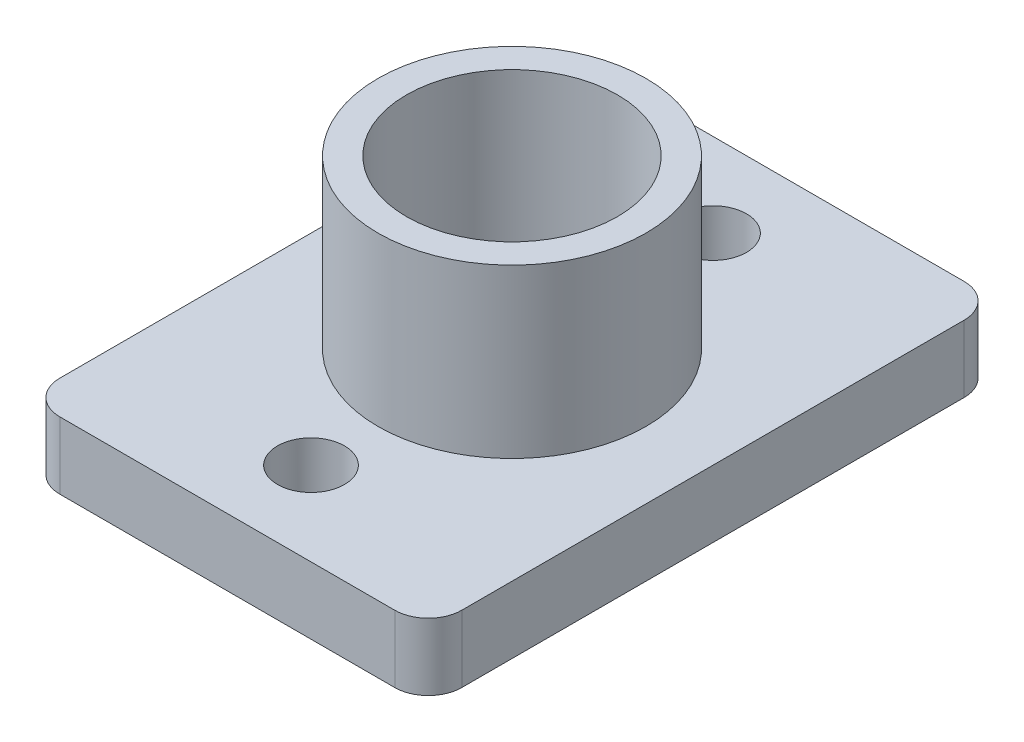
ISO-10303-21;
HEADER;
FILE_DESCRIPTION(('STEP AP214'),'2;1');
FILE_NAME('part.step','',(''),(''),'','','');
FILE_SCHEMA(('AUTOMOTIVE_DESIGN { 1 0 10303 214 1 1 1 1 }'));
ENDSEC;
DATA;
#1=APPLICATION_CONTEXT('core data for automotive mechanical design processes');
#2=APPLICATION_PROTOCOL_DEFINITION('international standard','automotive_design',2000,#1);
#3=PRODUCT_CONTEXT('',#1,'mechanical');
#4=PRODUCT('Part','Part','',(#3));
#5=PRODUCT_RELATED_PRODUCT_CATEGORY('part','',(#4));
#6=PRODUCT_DEFINITION_FORMATION('','',#4);
#7=PRODUCT_DEFINITION_CONTEXT('part definition',#1,'design');
#8=PRODUCT_DEFINITION('design','',#6,#7);
#9=PRODUCT_DEFINITION_SHAPE('','',#8);
#10=(LENGTH_UNIT() NAMED_UNIT(*) SI_UNIT(.MILLI.,.METRE.));
#11=(NAMED_UNIT(*) PLANE_ANGLE_UNIT() SI_UNIT($,.RADIAN.));
#12=(NAMED_UNIT(*) SI_UNIT($,.STERADIAN.) SOLID_ANGLE_UNIT());
#13=UNCERTAINTY_MEASURE_WITH_UNIT(LENGTH_MEASURE(1.E-05),#10,'distance_accuracy_value','');
#14=(GEOMETRIC_REPRESENTATION_CONTEXT(3) GLOBAL_UNCERTAINTY_ASSIGNED_CONTEXT((#13)) GLOBAL_UNIT_ASSIGNED_CONTEXT((#10,
#11,#12)) REPRESENTATION_CONTEXT('',''));
#15=CARTESIAN_POINT('',(0.,0.,0.));
#16=DIRECTION('',(0.,0.,1.));
#17=DIRECTION('',(1.,0.,0.));
#18=AXIS2_PLACEMENT_3D('',#15,#16,#17);
#19=CARTESIAN_POINT('',(0.,2.,0.));
#20=DIRECTION('',(1.,0.,0.));
#21=DIRECTION('',(0.,0.,-1.));
#22=AXIS2_PLACEMENT_3D('',#19,#20,#21);
#23=PLANE('',#22);
#24=DIRECTION('',(0.,0.,1.));
#25=VECTOR('',#24,1.);
#26=CARTESIAN_POINT('',(0.,2.,0.));
#27=LINE('',#26,#25);
#28=CARTESIAN_POINT('',(0.,2.,-16.));
#29=VERTEX_POINT('',#28);
#30=CARTESIAN_POINT('',(0.,2.,-1.));
#31=VERTEX_POINT('',#30);
#32=EDGE_CURVE('E130',#29,#31,#27,.T.);
#33=ORIENTED_EDGE('',*,*,#32,.F.);
#34=DIRECTION('',(0.,-1.,0.));
#35=VECTOR('',#34,1.);
#36=CARTESIAN_POINT('',(0.,2.,-16.));
#37=LINE('',#36,#35);
#38=CARTESIAN_POINT('',(0.,0.,-16.));
#39=VERTEX_POINT('',#38);
#40=EDGE_CURVE('E114',#29,#39,#37,.T.);
#41=ORIENTED_EDGE('',*,*,#40,.T.);
#42=DIRECTION('',(0.,0.,1.));
#43=VECTOR('',#42,1.);
#44=CARTESIAN_POINT('',(0.,0.,0.));
#45=LINE('',#44,#43);
#46=CARTESIAN_POINT('',(0.,0.,-1.));
#47=VERTEX_POINT('',#46);
#48=EDGE_CURVE('E127',#39,#47,#45,.T.);
#49=ORIENTED_EDGE('',*,*,#48,.T.);
#50=DIRECTION('',(0.,-1.,0.));
#51=VECTOR('',#50,1.);
#52=CARTESIAN_POINT('',(0.,2.,-1.));
#53=LINE('',#52,#51);
#54=EDGE_CURVE('E133',#47,#31,#53,.F.);
#55=ORIENTED_EDGE('',*,*,#54,.T.);
#56=EDGE_LOOP('',(#33,#41,#49,#55));
#57=FACE_BOUND('',#56,.T.);
#58=ADVANCED_FACE('F43',(#57),#23,.F.);
#59=CARTESIAN_POINT('',(0.,2.,0.));
#60=DIRECTION('',(0.,0.,-1.));
#61=DIRECTION('',(-1.,0.,0.));
#62=AXIS2_PLACEMENT_3D('',#59,#60,#61);
#63=PLANE('',#62);
#64=DIRECTION('',(1.,0.,0.));
#65=VECTOR('',#64,1.);
#66=CARTESIAN_POINT('',(0.,0.,0.));
#67=LINE('',#66,#65);
#68=CARTESIAN_POINT('',(1.,0.,0.));
#69=VERTEX_POINT('',#68);
#70=CARTESIAN_POINT('',(11.,0.,0.));
#71=VERTEX_POINT('',#70);
#72=EDGE_CURVE('E138',#69,#71,#67,.T.);
#73=ORIENTED_EDGE('',*,*,#72,.T.);
#74=DIRECTION('',(0.,-1.,0.));
#75=VECTOR('',#74,1.);
#76=CARTESIAN_POINT('',(11.,2.,0.));
#77=LINE('',#76,#75);
#78=CARTESIAN_POINT('',(11.,2.,0.));
#79=VERTEX_POINT('',#78);
#80=EDGE_CURVE('E11',#71,#79,#77,.F.);
#81=ORIENTED_EDGE('',*,*,#80,.T.);
#82=DIRECTION('',(1.,0.,0.));
#83=VECTOR('',#82,1.);
#84=CARTESIAN_POINT('',(0.,2.,0.));
#85=LINE('',#84,#83);
#86=CARTESIAN_POINT('',(1.,2.,0.));
#87=VERTEX_POINT('',#86);
#88=EDGE_CURVE('E196',#87,#79,#85,.T.);
#89=ORIENTED_EDGE('',*,*,#88,.F.);
#90=DIRECTION('',(0.,-1.,0.));
#91=VECTOR('',#90,1.);
#92=CARTESIAN_POINT('',(1.,2.,0.));
#93=LINE('',#92,#91);
#94=EDGE_CURVE('E52',#87,#69,#93,.T.);
#95=ORIENTED_EDGE('',*,*,#94,.T.);
#96=EDGE_LOOP('',(#73,#81,#89,#95));
#97=FACE_BOUND('',#96,.T.);
#98=ADVANCED_FACE('F194',(#97),#63,.F.);
#99=CARTESIAN_POINT('',(12.,2.,0.));
#100=DIRECTION('',(-1.,0.,0.));
#101=DIRECTION('',(0.,0.,1.));
#102=AXIS2_PLACEMENT_3D('',#99,#100,#101);
#103=PLANE('',#102);
#104=DIRECTION('',(0.,0.,-1.));
#105=VECTOR('',#104,1.);
#106=CARTESIAN_POINT('',(12.,0.,0.));
#107=LINE('',#106,#105);
#108=CARTESIAN_POINT('',(12.,0.,-1.));
#109=VERTEX_POINT('',#108);
#110=CARTESIAN_POINT('',(12.,0.,-16.));
#111=VERTEX_POINT('',#110);
#112=EDGE_CURVE('E144',#109,#111,#107,.T.);
#113=ORIENTED_EDGE('',*,*,#112,.T.);
#114=DIRECTION('',(0.,-1.,0.));
#115=VECTOR('',#114,1.);
#116=CARTESIAN_POINT('',(12.,2.,-16.));
#117=LINE('',#116,#115);
#118=CARTESIAN_POINT('',(12.,2.,-16.));
#119=VERTEX_POINT('',#118);
#120=EDGE_CURVE('E59',#111,#119,#117,.F.);
#121=ORIENTED_EDGE('',*,*,#120,.T.);
#122=DIRECTION('',(0.,0.,-1.));
#123=VECTOR('',#122,1.);
#124=CARTESIAN_POINT('',(12.,2.,0.));
#125=LINE('',#124,#123);
#126=CARTESIAN_POINT('',(12.,2.,-1.));
#127=VERTEX_POINT('',#126);
#128=EDGE_CURVE('E204',#127,#119,#125,.T.);
#129=ORIENTED_EDGE('',*,*,#128,.F.);
#130=DIRECTION('',(0.,-1.,0.));
#131=VECTOR('',#130,1.);
#132=CARTESIAN_POINT('',(12.,2.,-1.));
#133=LINE('',#132,#131);
#134=EDGE_CURVE('E184',#127,#109,#133,.T.);
#135=ORIENTED_EDGE('',*,*,#134,.T.);
#136=EDGE_LOOP('',(#113,#121,#129,#135));
#137=FACE_BOUND('',#136,.T.);
#138=ADVANCED_FACE('F203',(#137),#103,.F.);
#139=CARTESIAN_POINT('',(0.,2.,-17.));
#140=DIRECTION('',(0.,0.,1.));
#141=DIRECTION('',(1.,0.,0.));
#142=AXIS2_PLACEMENT_3D('',#139,#140,#141);
#143=PLANE('',#142);
#144=DIRECTION('',(-1.,0.,0.));
#145=VECTOR('',#144,1.);
#146=CARTESIAN_POINT('',(0.,0.,-17.));
#147=LINE('',#146,#145);
#148=CARTESIAN_POINT('',(11.,0.,-17.));
#149=VERTEX_POINT('',#148);
#150=CARTESIAN_POINT('',(1.,0.,-17.));
#151=VERTEX_POINT('',#150);
#152=EDGE_CURVE('E155',#149,#151,#147,.T.);
#153=ORIENTED_EDGE('',*,*,#152,.T.);
#154=DIRECTION('',(0.,-1.,0.));
#155=VECTOR('',#154,1.);
#156=CARTESIAN_POINT('',(1.,2.,-17.));
#157=LINE('',#156,#155);
#158=CARTESIAN_POINT('',(1.,2.,-17.));
#159=VERTEX_POINT('',#158);
#160=EDGE_CURVE('E115',#151,#159,#157,.F.);
#161=ORIENTED_EDGE('',*,*,#160,.T.);
#162=DIRECTION('',(-1.,0.,0.));
#163=VECTOR('',#162,1.);
#164=CARTESIAN_POINT('',(0.,2.,-17.));
#165=LINE('',#164,#163);
#166=CARTESIAN_POINT('',(11.,2.,-17.));
#167=VERTEX_POINT('',#166);
#168=EDGE_CURVE('E150',#167,#159,#165,.T.);
#169=ORIENTED_EDGE('',*,*,#168,.F.);
#170=DIRECTION('',(0.,-1.,0.));
#171=VECTOR('',#170,1.);
#172=CARTESIAN_POINT('',(11.,2.,-17.));
#173=LINE('',#172,#171);
#174=EDGE_CURVE('E121',#167,#149,#173,.T.);
#175=ORIENTED_EDGE('',*,*,#174,.T.);
#176=EDGE_LOOP('',(#153,#161,#169,#175));
#177=FACE_BOUND('',#176,.T.);
#178=ADVANCED_FACE('F254',(#177),#143,.F.);
#179=CARTESIAN_POINT('',(0.,2.,0.));
#180=DIRECTION('',(0.,-1.,0.));
#181=DIRECTION('',(0.,0.,-1.));
#182=AXIS2_PLACEMENT_3D('',#179,#180,#181);
#183=PLANE('',#182);
#184=CARTESIAN_POINT('',(6.,2.,-2.5));
#185=DIRECTION('',(0.,-1.,0.));
#186=DIRECTION('',(0.,0.,-1.));
#187=AXIS2_PLACEMENT_3D('',#184,#185,#186);
#188=CIRCLE('',#187,1.);
#189=CARTESIAN_POINT('',(6.,2.,-3.5));
#190=VERTEX_POINT('',#189);
#191=EDGE_CURVE('E147',#190,#190,#188,.T.);
#192=ORIENTED_EDGE('',*,*,#191,.T.);
#193=EDGE_LOOP('',(#192));
#194=FACE_BOUND('',#193,.T.);
#195=CARTESIAN_POINT('',(6.,2.,-14.5));
#196=DIRECTION('',(0.,-1.,0.));
#197=DIRECTION('',(0.,0.,-1.));
#198=AXIS2_PLACEMENT_3D('',#195,#196,#197);
#199=CIRCLE('',#198,1.);
#200=CARTESIAN_POINT('',(6.,2.,-15.5));
#201=VERTEX_POINT('',#200);
#202=EDGE_CURVE('E220',#201,#201,#199,.T.);
#203=ORIENTED_EDGE('',*,*,#202,.T.);
#204=EDGE_LOOP('',(#203));
#205=FACE_BOUND('',#204,.T.);
#206=CARTESIAN_POINT('',(6.,2.,-8.5));
#207=DIRECTION('',(0.,1.,0.));
#208=DIRECTION('',(0.,0.,1.));
#209=AXIS2_PLACEMENT_3D('',#206,#207,#208);
#210=CIRCLE('',#209,4.);
#211=CARTESIAN_POINT('',(6.,2.,-4.5));
#212=VERTEX_POINT('',#211);
#213=EDGE_CURVE('E159',#212,#212,#210,.T.);
#214=ORIENTED_EDGE('',*,*,#213,.F.);
#215=EDGE_LOOP('',(#214));
#216=FACE_BOUND('',#215,.T.);
#217=ORIENTED_EDGE('',*,*,#168,.T.);
#218=CARTESIAN_POINT('',(1.,2.,-16.));
#219=DIRECTION('',(0.,-1.,0.));
#220=DIRECTION('',(0.,0.,-1.));
#221=AXIS2_PLACEMENT_3D('',#218,#219,#220);
#222=CIRCLE('',#221,1.);
#223=EDGE_CURVE('E181',#159,#29,#222,.F.);
#224=ORIENTED_EDGE('',*,*,#223,.T.);
#225=ORIENTED_EDGE('',*,*,#32,.T.);
#226=CARTESIAN_POINT('',(1.,2.,-1.));
#227=DIRECTION('',(0.,-1.,0.));
#228=DIRECTION('',(0.,0.,-1.));
#229=AXIS2_PLACEMENT_3D('',#226,#227,#228);
#230=CIRCLE('',#229,1.);
#231=EDGE_CURVE('E173',#31,#87,#230,.F.);
#232=ORIENTED_EDGE('',*,*,#231,.T.);
#233=ORIENTED_EDGE('',*,*,#88,.T.);
#234=CARTESIAN_POINT('',(11.,2.,-1.));
#235=DIRECTION('',(0.,-1.,0.));
#236=DIRECTION('',(0.,0.,-1.));
#237=AXIS2_PLACEMENT_3D('',#234,#235,#236);
#238=CIRCLE('',#237,1.);
#239=EDGE_CURVE('E66',#79,#127,#238,.F.);
#240=ORIENTED_EDGE('',*,*,#239,.T.);
#241=ORIENTED_EDGE('',*,*,#128,.T.);
#242=CARTESIAN_POINT('',(11.,2.,-16.));
#243=DIRECTION('',(0.,-1.,0.));
#244=DIRECTION('',(0.,0.,-1.));
#245=AXIS2_PLACEMENT_3D('',#242,#243,#244);
#246=CIRCLE('',#245,1.);
#247=EDGE_CURVE('E178',#119,#167,#246,.F.);
#248=ORIENTED_EDGE('',*,*,#247,.T.);
#249=EDGE_LOOP('',(#217,#224,#225,#232,#233,#240,#241,#248));
#250=FACE_BOUND('',#249,.T.);
#251=ADVANCED_FACE('F251',(#194,#205,#216,#250),#183,.F.);
#252=CARTESIAN_POINT('',(0.,0.,0.));
#253=DIRECTION('',(0.,-1.,0.));
#254=DIRECTION('',(0.,0.,-1.));
#255=AXIS2_PLACEMENT_3D('',#252,#253,#254);
#256=PLANE('',#255);
#257=CARTESIAN_POINT('',(6.,0.,-2.5));
#258=DIRECTION('',(0.,1.,0.));
#259=DIRECTION('',(0.,0.,1.));
#260=AXIS2_PLACEMENT_3D('',#257,#258,#259);
#261=CIRCLE('',#260,1.);
#262=CARTESIAN_POINT('',(6.,0.,-1.5));
#263=VERTEX_POINT('',#262);
#264=EDGE_CURVE('E233',#263,#263,#261,.T.);
#265=ORIENTED_EDGE('',*,*,#264,.T.);
#266=EDGE_LOOP('',(#265));
#267=FACE_BOUND('',#266,.T.);
#268=CARTESIAN_POINT('',(6.,0.,-14.5));
#269=DIRECTION('',(0.,1.,0.));
#270=DIRECTION('',(0.,0.,1.));
#271=AXIS2_PLACEMENT_3D('',#268,#269,#270);
#272=CIRCLE('',#271,1.);
#273=CARTESIAN_POINT('',(6.,0.,-13.5));
#274=VERTEX_POINT('',#273);
#275=EDGE_CURVE('E229',#274,#274,#272,.T.);
#276=ORIENTED_EDGE('',*,*,#275,.T.);
#277=EDGE_LOOP('',(#276));
#278=FACE_BOUND('',#277,.T.);
#279=CARTESIAN_POINT('',(6.,0.,-8.5));
#280=DIRECTION('',(0.,1.,0.));
#281=DIRECTION('',(0.,0.,1.));
#282=AXIS2_PLACEMENT_3D('',#279,#280,#281);
#283=CIRCLE('',#282,3.15);
#284=CARTESIAN_POINT('',(6.,0.,-5.35));
#285=VERTEX_POINT('',#284);
#286=EDGE_CURVE('E224',#285,#285,#283,.T.);
#287=ORIENTED_EDGE('',*,*,#286,.T.);
#288=EDGE_LOOP('',(#287));
#289=FACE_BOUND('',#288,.T.);
#290=ORIENTED_EDGE('',*,*,#48,.F.);
#291=CARTESIAN_POINT('',(1.,0.,-16.));
#292=DIRECTION('',(0.,-1.,0.));
#293=DIRECTION('',(0.,0.,-1.));
#294=AXIS2_PLACEMENT_3D('',#291,#292,#293);
#295=CIRCLE('',#294,1.);
#296=EDGE_CURVE('E110',#39,#151,#295,.T.);
#297=ORIENTED_EDGE('',*,*,#296,.T.);
#298=ORIENTED_EDGE('',*,*,#152,.F.);
#299=CARTESIAN_POINT('',(11.,0.,-16.));
#300=DIRECTION('',(0.,-1.,0.));
#301=DIRECTION('',(0.,0.,-1.));
#302=AXIS2_PLACEMENT_3D('',#299,#300,#301);
#303=CIRCLE('',#302,1.);
#304=EDGE_CURVE('E122',#149,#111,#303,.T.);
#305=ORIENTED_EDGE('',*,*,#304,.T.);
#306=ORIENTED_EDGE('',*,*,#112,.F.);
#307=CARTESIAN_POINT('',(11.,0.,-1.));
#308=DIRECTION('',(0.,-1.,0.));
#309=DIRECTION('',(0.,0.,-1.));
#310=AXIS2_PLACEMENT_3D('',#307,#308,#309);
#311=CIRCLE('',#310,1.);
#312=EDGE_CURVE('E163',#109,#71,#311,.T.);
#313=ORIENTED_EDGE('',*,*,#312,.T.);
#314=ORIENTED_EDGE('',*,*,#72,.F.);
#315=CARTESIAN_POINT('',(1.,0.,-1.));
#316=DIRECTION('',(0.,-1.,0.));
#317=DIRECTION('',(0.,0.,-1.));
#318=AXIS2_PLACEMENT_3D('',#315,#316,#317);
#319=CIRCLE('',#318,1.);
#320=EDGE_CURVE('E132',#69,#47,#319,.T.);
#321=ORIENTED_EDGE('',*,*,#320,.T.);
#322=EDGE_LOOP('',(#290,#297,#298,#305,#306,#313,#314,#321));
#323=FACE_BOUND('',#322,.T.);
#324=ADVANCED_FACE('F135',(#267,#278,#289,#323),#256,.T.);
#325=CARTESIAN_POINT('',(6.,7.,-8.5));
#326=DIRECTION('',(0.,-1.,0.));
#327=DIRECTION('',(0.,0.,-1.));
#328=AXIS2_PLACEMENT_3D('',#325,#326,#327);
#329=CYLINDRICAL_SURFACE('',#328,4.);
#330=CARTESIAN_POINT('',(6.,7.,-8.5));
#331=DIRECTION('',(0.,1.,0.));
#332=DIRECTION('',(0.,0.,1.));
#333=AXIS2_PLACEMENT_3D('',#330,#331,#332);
#334=CIRCLE('',#333,4.);
#335=CARTESIAN_POINT('',(6.,7.,-4.5));
#336=VERTEX_POINT('',#335);
#337=EDGE_CURVE('E139',#336,#336,#334,.T.);
#338=ORIENTED_EDGE('',*,*,#337,.F.);
#339=EDGE_LOOP('',(#338));
#340=FACE_BOUND('',#339,.T.);
#341=ORIENTED_EDGE('',*,*,#213,.T.);
#342=EDGE_LOOP('',(#341));
#343=FACE_BOUND('',#342,.T.);
#344=ADVANCED_FACE('F282',(#340,#343),#329,.T.);
#345=CARTESIAN_POINT('',(6.,7.,-8.5));
#346=DIRECTION('',(0.,1.,0.));
#347=DIRECTION('',(0.,0.,1.));
#348=AXIS2_PLACEMENT_3D('',#345,#346,#347);
#349=PLANE('',#348);
#350=CARTESIAN_POINT('',(6.,7.,-8.5));
#351=DIRECTION('',(0.,1.,0.));
#352=DIRECTION('',(0.,0.,1.));
#353=AXIS2_PLACEMENT_3D('',#350,#351,#352);
#354=CIRCLE('',#353,3.15);
#355=CARTESIAN_POINT('',(6.,7.,-5.35));
#356=VERTEX_POINT('',#355);
#357=EDGE_CURVE('E225',#356,#356,#354,.T.);
#358=ORIENTED_EDGE('',*,*,#357,.F.);
#359=EDGE_LOOP('',(#358));
#360=FACE_BOUND('',#359,.T.);
#361=ORIENTED_EDGE('',*,*,#337,.T.);
#362=EDGE_LOOP('',(#361));
#363=FACE_BOUND('',#362,.T.);
#364=ADVANCED_FACE('F287',(#360,#363),#349,.T.);
#365=CARTESIAN_POINT('',(6.,0.,-8.5));
#366=DIRECTION('',(0.,1.,0.));
#367=DIRECTION('',(0.,0.,1.));
#368=AXIS2_PLACEMENT_3D('',#365,#366,#367);
#369=CYLINDRICAL_SURFACE('',#368,3.15);
#370=ORIENTED_EDGE('',*,*,#286,.F.);
#371=EDGE_LOOP('',(#370));
#372=FACE_BOUND('',#371,.T.);
#373=ORIENTED_EDGE('',*,*,#357,.T.);
#374=EDGE_LOOP('',(#373));
#375=FACE_BOUND('',#374,.T.);
#376=ADVANCED_FACE('F247',(#372,#375),#369,.F.);
#377=CARTESIAN_POINT('',(6.,0.,-14.5));
#378=DIRECTION('',(0.,1.,0.));
#379=DIRECTION('',(0.,0.,1.));
#380=AXIS2_PLACEMENT_3D('',#377,#378,#379);
#381=CYLINDRICAL_SURFACE('',#380,1.);
#382=ORIENTED_EDGE('',*,*,#275,.F.);
#383=EDGE_LOOP('',(#382));
#384=FACE_BOUND('',#383,.T.);
#385=ORIENTED_EDGE('',*,*,#202,.F.);
#386=EDGE_LOOP('',(#385));
#387=FACE_BOUND('',#386,.T.);
#388=ADVANCED_FACE('F243',(#384,#387),#381,.F.);
#389=CARTESIAN_POINT('',(6.,0.,-2.5));
#390=DIRECTION('',(0.,1.,0.));
#391=DIRECTION('',(0.,0.,1.));
#392=AXIS2_PLACEMENT_3D('',#389,#390,#391);
#393=CYLINDRICAL_SURFACE('',#392,1.);
#394=ORIENTED_EDGE('',*,*,#264,.F.);
#395=EDGE_LOOP('',(#394));
#396=FACE_BOUND('',#395,.T.);
#397=ORIENTED_EDGE('',*,*,#191,.F.);
#398=EDGE_LOOP('',(#397));
#399=FACE_BOUND('',#398,.T.);
#400=ADVANCED_FACE('F246',(#396,#399),#393,.F.);
#401=CARTESIAN_POINT('',(1.,2.,-16.));
#402=DIRECTION('',(0.,-1.,0.));
#403=DIRECTION('',(0.,0.,-1.));
#404=AXIS2_PLACEMENT_3D('',#401,#402,#403);
#405=CYLINDRICAL_SURFACE('',#404,1.);
#406=ORIENTED_EDGE('',*,*,#223,.F.);
#407=ORIENTED_EDGE('',*,*,#160,.F.);
#408=ORIENTED_EDGE('',*,*,#296,.F.);
#409=ORIENTED_EDGE('',*,*,#40,.F.);
#410=EDGE_LOOP('',(#406,#407,#408,#409));
#411=FACE_BOUND('',#410,.T.);
#412=ADVANCED_FACE('F113',(#411),#405,.T.);
#413=CARTESIAN_POINT('',(11.,2.,-16.));
#414=DIRECTION('',(0.,-1.,0.));
#415=DIRECTION('',(0.,0.,-1.));
#416=AXIS2_PLACEMENT_3D('',#413,#414,#415);
#417=CYLINDRICAL_SURFACE('',#416,1.);
#418=ORIENTED_EDGE('',*,*,#247,.F.);
#419=ORIENTED_EDGE('',*,*,#120,.F.);
#420=ORIENTED_EDGE('',*,*,#304,.F.);
#421=ORIENTED_EDGE('',*,*,#174,.F.);
#422=EDGE_LOOP('',(#418,#419,#420,#421));
#423=FACE_BOUND('',#422,.T.);
#424=ADVANCED_FACE('F262',(#423),#417,.T.);
#425=CARTESIAN_POINT('',(11.,2.,-1.));
#426=DIRECTION('',(0.,-1.,0.));
#427=DIRECTION('',(0.,0.,-1.));
#428=AXIS2_PLACEMENT_3D('',#425,#426,#427);
#429=CYLINDRICAL_SURFACE('',#428,1.);
#430=ORIENTED_EDGE('',*,*,#239,.F.);
#431=ORIENTED_EDGE('',*,*,#80,.F.);
#432=ORIENTED_EDGE('',*,*,#312,.F.);
#433=ORIENTED_EDGE('',*,*,#134,.F.);
#434=EDGE_LOOP('',(#430,#431,#432,#433));
#435=FACE_BOUND('',#434,.T.);
#436=ADVANCED_FACE('F202',(#435),#429,.T.);
#437=CARTESIAN_POINT('',(1.,2.,-1.));
#438=DIRECTION('',(0.,-1.,0.));
#439=DIRECTION('',(0.,0.,-1.));
#440=AXIS2_PLACEMENT_3D('',#437,#438,#439);
#441=CYLINDRICAL_SURFACE('',#440,1.);
#442=ORIENTED_EDGE('',*,*,#231,.F.);
#443=ORIENTED_EDGE('',*,*,#54,.F.);
#444=ORIENTED_EDGE('',*,*,#320,.F.);
#445=ORIENTED_EDGE('',*,*,#94,.F.);
#446=EDGE_LOOP('',(#442,#443,#444,#445));
#447=FACE_BOUND('',#446,.T.);
#448=ADVANCED_FACE('F45',(#447),#441,.T.);
#449=CLOSED_SHELL('',(#58,#98,#138,#178,#251,#324,#344,#364,#376,#388,#400,#412,#424,#436,#448));
#450=MANIFOLD_SOLID_BREP('B2',#449);
#451=ADVANCED_BREP_SHAPE_REPRESENTATION('',(#18,#450),#14);
#452=SHAPE_DEFINITION_REPRESENTATION(#9,#451);
ENDSEC;
END-ISO-10303-21;
